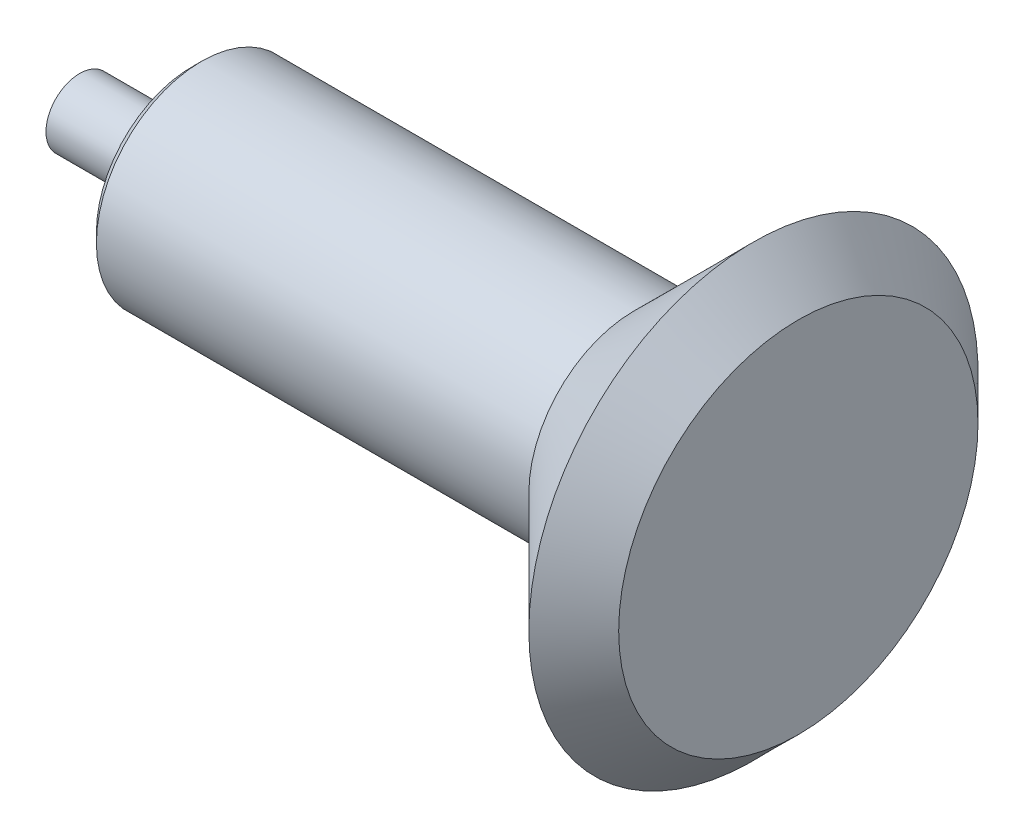
ISO-10303-21;
HEADER;
FILE_DESCRIPTION(('STEP AP214'),'2;1');
FILE_NAME('part.step','',(''),(''),'','','');
FILE_SCHEMA(('AUTOMOTIVE_DESIGN { 1 0 10303 214 1 1 1 1 }'));
ENDSEC;
DATA;
#1=APPLICATION_CONTEXT('core data for automotive mechanical design processes');
#2=APPLICATION_PROTOCOL_DEFINITION('international standard','automotive_design',2000,#1);
#3=PRODUCT_CONTEXT('',#1,'mechanical');
#4=PRODUCT('Part','Part','',(#3));
#5=PRODUCT_RELATED_PRODUCT_CATEGORY('part','',(#4));
#6=PRODUCT_DEFINITION_FORMATION('','',#4);
#7=PRODUCT_DEFINITION_CONTEXT('part definition',#1,'design');
#8=PRODUCT_DEFINITION('design','',#6,#7);
#9=PRODUCT_DEFINITION_SHAPE('','',#8);
#10=(LENGTH_UNIT() NAMED_UNIT(*) SI_UNIT(.MILLI.,.METRE.));
#11=(NAMED_UNIT(*) PLANE_ANGLE_UNIT() SI_UNIT($,.RADIAN.));
#12=(NAMED_UNIT(*) SI_UNIT($,.STERADIAN.) SOLID_ANGLE_UNIT());
#13=UNCERTAINTY_MEASURE_WITH_UNIT(LENGTH_MEASURE(1.E-05),#10,'distance_accuracy_value','');
#14=(GEOMETRIC_REPRESENTATION_CONTEXT(3) GLOBAL_UNCERTAINTY_ASSIGNED_CONTEXT((#13)) GLOBAL_UNIT_ASSIGNED_CONTEXT((#10,
#11,#12)) REPRESENTATION_CONTEXT('',''));
#15=CARTESIAN_POINT('',(0.,0.,0.));
#16=DIRECTION('',(0.,0.,1.));
#17=DIRECTION('',(1.,0.,0.));
#18=AXIS2_PLACEMENT_3D('',#15,#16,#17);
#19=CARTESIAN_POINT('',(0.,0.,0.));
#20=DIRECTION('',(-1.,0.,0.));
#21=DIRECTION('',(0.,0.,1.));
#22=AXIS2_PLACEMENT_3D('',#19,#20,#21);
#23=PLANE('',#22);
#24=CARTESIAN_POINT('',(0.,0.,0.));
#25=DIRECTION('',(-1.,0.,0.));
#26=DIRECTION('',(0.,0.,1.));
#27=AXIS2_PLACEMENT_3D('',#24,#25,#26);
#28=CIRCLE('',#27,7.5);
#29=CARTESIAN_POINT('',(0.,0.,7.5));
#30=VERTEX_POINT('',#29);
#31=EDGE_CURVE('E62',#30,#30,#28,.T.);
#32=ORIENTED_EDGE('',*,*,#31,.T.);
#33=EDGE_LOOP('',(#32));
#34=FACE_BOUND('',#33,.T.);
#35=ADVANCED_FACE('F37',(#34),#23,.T.);
#36=CARTESIAN_POINT('',(160.,0.,0.));
#37=DIRECTION('',(-1.,0.,0.));
#38=DIRECTION('',(0.,0.,1.));
#39=AXIS2_PLACEMENT_3D('',#36,#37,#38);
#40=PLANE('',#39);
#41=CARTESIAN_POINT('',(160.,0.,0.));
#42=DIRECTION('',(-1.,0.,0.));
#43=DIRECTION('',(0.,0.,1.));
#44=AXIS2_PLACEMENT_3D('',#41,#42,#43);
#45=CIRCLE('',#44,40.);
#46=CARTESIAN_POINT('',(160.,0.,40.));
#47=VERTEX_POINT('',#46);
#48=EDGE_CURVE('E10',#47,#47,#45,.T.);
#49=ORIENTED_EDGE('',*,*,#48,.F.);
#50=EDGE_LOOP('',(#49));
#51=FACE_BOUND('',#50,.T.);
#52=ADVANCED_FACE('F79',(#51),#40,.F.);
#53=CARTESIAN_POINT('',(160.,0.,0.));
#54=DIRECTION('',(-1.,0.,0.));
#55=DIRECTION('',(0.,0.,1.));
#56=AXIS2_PLACEMENT_3D('',#53,#54,#55);
#57=CONICAL_SURFACE('',#56,40.,0.785398163397446);
#58=CARTESIAN_POINT('',(150.,0.,0.));
#59=DIRECTION('',(-1.,0.,0.));
#60=DIRECTION('',(0.,0.,1.));
#61=AXIS2_PLACEMENT_3D('',#58,#59,#60);
#62=CIRCLE('',#61,50.);
#63=CARTESIAN_POINT('',(150.,0.,50.));
#64=VERTEX_POINT('',#63);
#65=EDGE_CURVE('E43',#64,#64,#62,.T.);
#66=ORIENTED_EDGE('',*,*,#65,.F.);
#67=EDGE_LOOP('',(#66));
#68=FACE_BOUND('',#67,.T.);
#69=ORIENTED_EDGE('',*,*,#48,.T.);
#70=EDGE_LOOP('',(#69));
#71=FACE_BOUND('',#70,.T.);
#72=ADVANCED_FACE('F83',(#68,#71),#57,.T.);
#73=CARTESIAN_POINT('',(123.402702597224,0.,0.));
#74=DIRECTION('',(1.,0.,0.));
#75=DIRECTION('',(0.,0.,-1.));
#76=AXIS2_PLACEMENT_3D('',#73,#74,#75);
#77=CONICAL_SURFACE('',#76,23.4027025972243,0.78539816339745);
#78=ORIENTED_EDGE('',*,*,#65,.T.);
#79=EDGE_LOOP('',(#78));
#80=FACE_BOUND('',#79,.T.);
#81=CARTESIAN_POINT('',(123.402702597224,0.,0.));
#82=DIRECTION('',(-1.,0.,0.));
#83=DIRECTION('',(0.,0.,1.));
#84=AXIS2_PLACEMENT_3D('',#81,#82,#83);
#85=CIRCLE('',#84,23.4027025972243);
#86=CARTESIAN_POINT('',(123.402702597224,0.,23.4027025972243));
#87=VERTEX_POINT('',#86);
#88=EDGE_CURVE('E47',#87,#87,#85,.T.);
#89=ORIENTED_EDGE('',*,*,#88,.F.);
#90=EDGE_LOOP('',(#89));
#91=FACE_BOUND('',#90,.T.);
#92=ADVANCED_FACE('F88',(#80,#91),#77,.T.);
#93=CARTESIAN_POINT('',(0.,0.,0.));
#94=DIRECTION('',(-1.,0.,0.));
#95=DIRECTION('',(0.,0.,1.));
#96=AXIS2_PLACEMENT_3D('',#93,#94,#95);
#97=CYLINDRICAL_SURFACE('',#96,23.4027025972243);
#98=ORIENTED_EDGE('',*,*,#88,.T.);
#99=EDGE_LOOP('',(#98));
#100=FACE_BOUND('',#99,.T.);
#101=CARTESIAN_POINT('',(27.1213203435596,0.,0.));
#102=DIRECTION('',(-1.,0.,0.));
#103=DIRECTION('',(0.,0.,1.));
#104=AXIS2_PLACEMENT_3D('',#101,#102,#103);
#105=CIRCLE('',#104,23.4027025972243);
#106=CARTESIAN_POINT('',(27.1213203435596,0.,23.4027025972243));
#107=VERTEX_POINT('',#106);
#108=EDGE_CURVE('E51',#107,#107,#105,.T.);
#109=ORIENTED_EDGE('',*,*,#108,.F.);
#110=EDGE_LOOP('',(#109));
#111=FACE_BOUND('',#110,.T.);
#112=ADVANCED_FACE('F94',(#100,#111),#97,.T.);
#113=CARTESIAN_POINT('',(25.,0.,0.));
#114=DIRECTION('',(1.,0.,0.));
#115=DIRECTION('',(0.,0.,-1.));
#116=AXIS2_PLACEMENT_3D('',#113,#114,#115);
#117=CONICAL_SURFACE('',#116,21.2813822536647,0.785398163397461);
#118=ORIENTED_EDGE('',*,*,#108,.T.);
#119=EDGE_LOOP('',(#118));
#120=FACE_BOUND('',#119,.T.);
#121=CARTESIAN_POINT('',(25.,0.,0.));
#122=DIRECTION('',(-1.,0.,0.));
#123=DIRECTION('',(0.,0.,1.));
#124=AXIS2_PLACEMENT_3D('',#121,#122,#123);
#125=CIRCLE('',#124,21.2813822536647);
#126=CARTESIAN_POINT('',(25.,0.,21.2813822536647));
#127=VERTEX_POINT('',#126);
#128=EDGE_CURVE('E56',#127,#127,#125,.T.);
#129=ORIENTED_EDGE('',*,*,#128,.F.);
#130=EDGE_LOOP('',(#129));
#131=FACE_BOUND('',#130,.T.);
#132=ADVANCED_FACE('F75',(#120,#131),#117,.T.);
#133=CARTESIAN_POINT('',(25.,0.,0.));
#134=DIRECTION('',(-1.,0.,0.));
#135=DIRECTION('',(0.,0.,1.));
#136=AXIS2_PLACEMENT_3D('',#133,#134,#135);
#137=PLANE('',#136);
#138=ORIENTED_EDGE('',*,*,#128,.T.);
#139=EDGE_LOOP('',(#138));
#140=FACE_BOUND('',#139,.T.);
#141=CARTESIAN_POINT('',(25.,0.,0.));
#142=DIRECTION('',(-1.,0.,0.));
#143=DIRECTION('',(0.,0.,1.));
#144=AXIS2_PLACEMENT_3D('',#141,#142,#143);
#145=CIRCLE('',#144,7.5);
#146=CARTESIAN_POINT('',(25.,0.,7.5));
#147=VERTEX_POINT('',#146);
#148=EDGE_CURVE('E59',#147,#147,#145,.T.);
#149=ORIENTED_EDGE('',*,*,#148,.F.);
#150=EDGE_LOOP('',(#149));
#151=FACE_BOUND('',#150,.T.);
#152=ADVANCED_FACE('F69',(#140,#151),#137,.T.);
#153=CARTESIAN_POINT('',(0.,0.,0.));
#154=DIRECTION('',(-1.,0.,0.));
#155=DIRECTION('',(0.,0.,1.));
#156=AXIS2_PLACEMENT_3D('',#153,#154,#155);
#157=CYLINDRICAL_SURFACE('',#156,7.5);
#158=ORIENTED_EDGE('',*,*,#148,.T.);
#159=EDGE_LOOP('',(#158));
#160=FACE_BOUND('',#159,.T.);
#161=ORIENTED_EDGE('',*,*,#31,.F.);
#162=EDGE_LOOP('',(#161));
#163=FACE_BOUND('',#162,.T.);
#164=ADVANCED_FACE('F67',(#160,#163),#157,.T.);
#165=CLOSED_SHELL('',(#35,#52,#72,#92,#112,#132,#152,#164));
#166=MANIFOLD_SOLID_BREP('B2',#165);
#167=ADVANCED_BREP_SHAPE_REPRESENTATION('',(#18,#166),#14);
#168=SHAPE_DEFINITION_REPRESENTATION(#9,#167);
ENDSEC;
END-ISO-10303-21;
